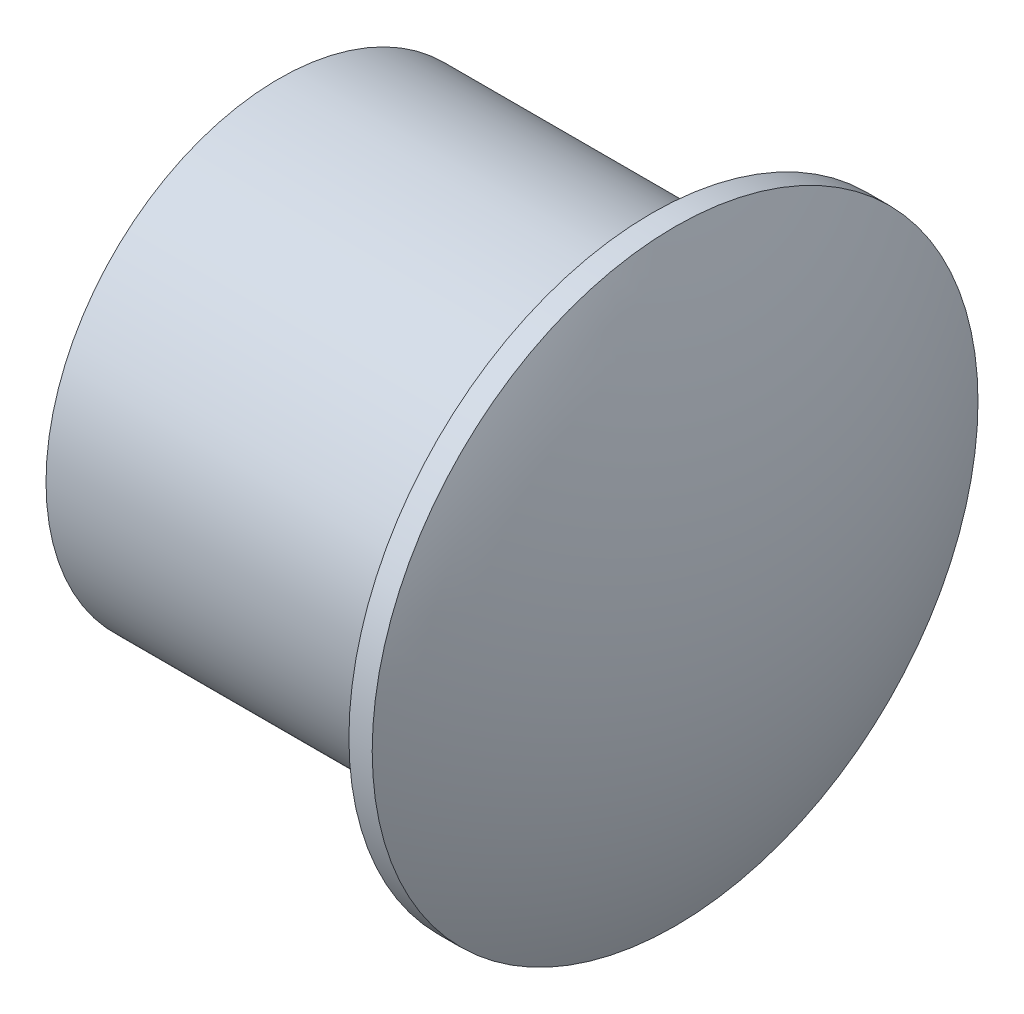
ISO-10303-21;
HEADER;
FILE_DESCRIPTION(('STEP AP214'),'2;1');
FILE_NAME('part.step','',(''),(''),'','','');
FILE_SCHEMA(('AUTOMOTIVE_DESIGN { 1 0 10303 214 1 1 1 1 }'));
ENDSEC;
DATA;
#1=APPLICATION_CONTEXT('core data for automotive mechanical design processes');
#2=APPLICATION_PROTOCOL_DEFINITION('international standard','automotive_design',2000,#1);
#3=PRODUCT_CONTEXT('',#1,'mechanical');
#4=PRODUCT('Part','Part','',(#3));
#5=PRODUCT_RELATED_PRODUCT_CATEGORY('part','',(#4));
#6=PRODUCT_DEFINITION_FORMATION('','',#4);
#7=PRODUCT_DEFINITION_CONTEXT('part definition',#1,'design');
#8=PRODUCT_DEFINITION('design','',#6,#7);
#9=PRODUCT_DEFINITION_SHAPE('','',#8);
#10=(LENGTH_UNIT() NAMED_UNIT(*) SI_UNIT(.MILLI.,.METRE.));
#11=(NAMED_UNIT(*) PLANE_ANGLE_UNIT() SI_UNIT($,.RADIAN.));
#12=(NAMED_UNIT(*) SI_UNIT($,.STERADIAN.) SOLID_ANGLE_UNIT());
#13=UNCERTAINTY_MEASURE_WITH_UNIT(LENGTH_MEASURE(1.E-05),#10,'distance_accuracy_value','');
#14=(GEOMETRIC_REPRESENTATION_CONTEXT(3) GLOBAL_UNCERTAINTY_ASSIGNED_CONTEXT((#13)) GLOBAL_UNIT_ASSIGNED_CONTEXT((#10,
#11,#12)) REPRESENTATION_CONTEXT('',''));
#15=CARTESIAN_POINT('',(0.,0.,0.));
#16=DIRECTION('',(0.,0.,1.));
#17=DIRECTION('',(1.,0.,0.));
#18=AXIS2_PLACEMENT_3D('',#15,#16,#17);
#19=CARTESIAN_POINT('',(-9.66666666666668,0.,0.));
#20=DIRECTION('',(-1.,0.,0.));
#21=DIRECTION('',(0.,1.,0.));
#22=AXIS2_PLACEMENT_3D('',#19,#20,#21);
#23=SPHERICAL_SURFACE('',#22,29.6666666666667);
#24=CARTESIAN_POINT('',(17.,0.,0.));
#25=DIRECTION('',(-1.,0.,0.));
#26=DIRECTION('',(0.,0.,1.));
#27=AXIS2_PLACEMENT_3D('',#24,#25,#26);
#28=CIRCLE('',#27,13.);
#29=CARTESIAN_POINT('',(17.,0.,13.));
#30=VERTEX_POINT('',#29);
#31=EDGE_CURVE('E10',#30,#30,#28,.T.);
#32=ORIENTED_EDGE('',*,*,#31,.F.);
#33=EDGE_LOOP('',(#32));
#34=FACE_BOUND('',#33,.T.);
#35=ADVANCED_FACE('F39',(#34),#23,.T.);
#36=CARTESIAN_POINT('',(0.,0.,0.));
#37=DIRECTION('',(-1.,0.,0.));
#38=DIRECTION('',(0.,0.,1.));
#39=AXIS2_PLACEMENT_3D('',#36,#37,#38);
#40=CYLINDRICAL_SURFACE('',#39,13.);
#41=CARTESIAN_POINT('',(16.,0.,0.));
#42=DIRECTION('',(-1.,0.,0.));
#43=DIRECTION('',(0.,0.,1.));
#44=AXIS2_PLACEMENT_3D('',#41,#42,#43);
#45=CIRCLE('',#44,13.);
#46=CARTESIAN_POINT('',(16.,0.,13.));
#47=VERTEX_POINT('',#46);
#48=EDGE_CURVE('E46',#47,#47,#45,.T.);
#49=ORIENTED_EDGE('',*,*,#48,.F.);
#50=EDGE_LOOP('',(#49));
#51=FACE_BOUND('',#50,.T.);
#52=ORIENTED_EDGE('',*,*,#31,.T.);
#53=EDGE_LOOP('',(#52));
#54=FACE_BOUND('',#53,.T.);
#55=ADVANCED_FACE('F73',(#51,#54),#40,.T.);
#56=CARTESIAN_POINT('',(16.,10.,0.));
#57=DIRECTION('',(1.,0.,0.));
#58=DIRECTION('',(0.,0.,-1.));
#59=AXIS2_PLACEMENT_3D('',#56,#57,#58);
#60=PLANE('',#59);
#61=CARTESIAN_POINT('',(16.,0.,0.));
#62=DIRECTION('',(-1.,0.,0.));
#63=DIRECTION('',(0.,0.,1.));
#64=AXIS2_PLACEMENT_3D('',#61,#62,#63);
#65=CIRCLE('',#64,10.);
#66=CARTESIAN_POINT('',(16.,0.,10.));
#67=VERTEX_POINT('',#66);
#68=EDGE_CURVE('E51',#67,#67,#65,.T.);
#69=ORIENTED_EDGE('',*,*,#68,.F.);
#70=EDGE_LOOP('',(#69));
#71=FACE_BOUND('',#70,.T.);
#72=ORIENTED_EDGE('',*,*,#48,.T.);
#73=EDGE_LOOP('',(#72));
#74=FACE_BOUND('',#73,.T.);
#75=ADVANCED_FACE('F68',(#71,#74),#60,.F.);
#76=CARTESIAN_POINT('',(0.,0.,0.));
#77=DIRECTION('',(-1.,0.,0.));
#78=DIRECTION('',(0.,0.,1.));
#79=AXIS2_PLACEMENT_3D('',#76,#77,#78);
#80=CYLINDRICAL_SURFACE('',#79,10.);
#81=CARTESIAN_POINT('',(0.,0.,0.));
#82=DIRECTION('',(-1.,0.,0.));
#83=DIRECTION('',(0.,0.,1.));
#84=AXIS2_PLACEMENT_3D('',#81,#82,#83);
#85=CIRCLE('',#84,10.);
#86=CARTESIAN_POINT('',(0.,0.,10.));
#87=VERTEX_POINT('',#86);
#88=EDGE_CURVE('E56',#87,#87,#85,.T.);
#89=ORIENTED_EDGE('',*,*,#88,.F.);
#90=EDGE_LOOP('',(#89));
#91=FACE_BOUND('',#90,.T.);
#92=ORIENTED_EDGE('',*,*,#68,.T.);
#93=EDGE_LOOP('',(#92));
#94=FACE_BOUND('',#93,.T.);
#95=ADVANCED_FACE('F65',(#91,#94),#80,.T.);
#96=CARTESIAN_POINT('',(0.,0.,0.));
#97=DIRECTION('',(1.,0.,0.));
#98=DIRECTION('',(0.,0.,-1.));
#99=AXIS2_PLACEMENT_3D('',#96,#97,#98);
#100=PLANE('',#99);
#101=ORIENTED_EDGE('',*,*,#88,.T.);
#102=EDGE_LOOP('',(#101));
#103=FACE_BOUND('',#102,.T.);
#104=ADVANCED_FACE('F63',(#103),#100,.F.);
#105=CLOSED_SHELL('',(#35,#55,#75,#95,#104));
#106=MANIFOLD_SOLID_BREP('B2',#105);
#107=ADVANCED_BREP_SHAPE_REPRESENTATION('',(#18,#106),#14);
#108=SHAPE_DEFINITION_REPRESENTATION(#9,#107);
ENDSEC;
END-ISO-10303-21;
